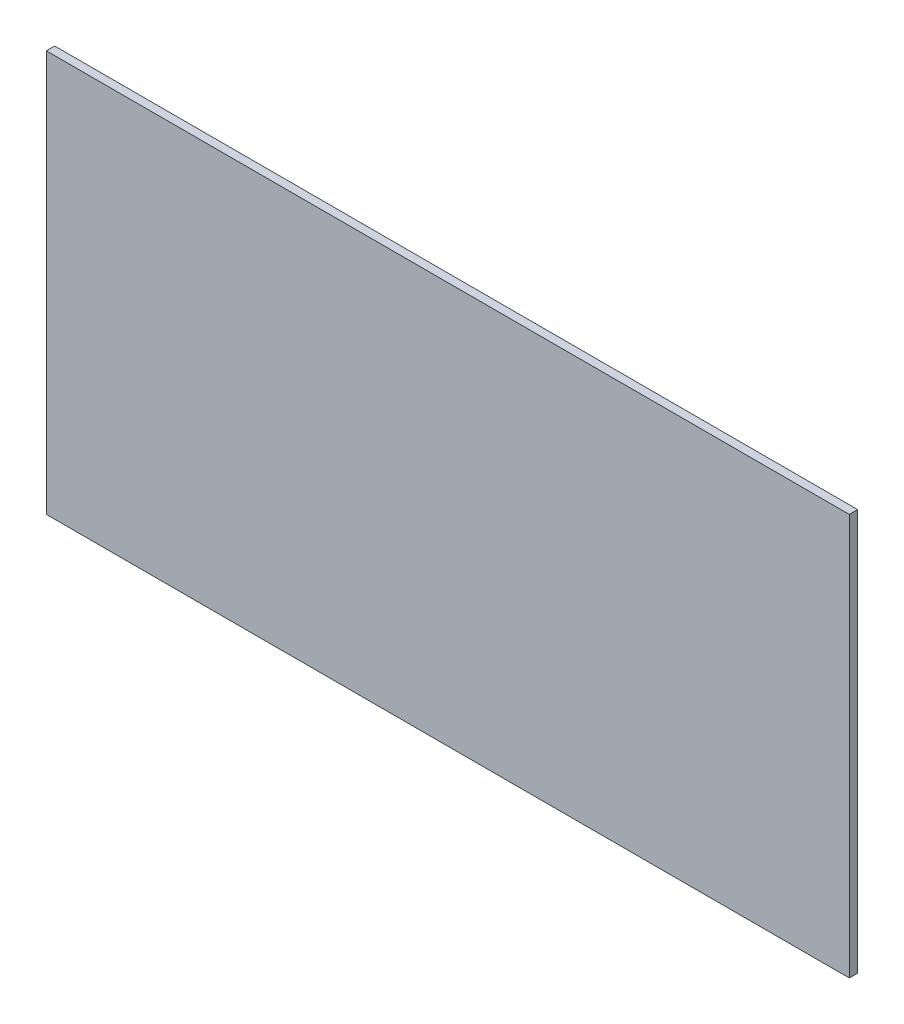
ISO-10303-21;
HEADER;
FILE_DESCRIPTION(('STEP AP214'),'2;1');
FILE_NAME('part.step','',(''),(''),'','','');
FILE_SCHEMA(('AUTOMOTIVE_DESIGN { 1 0 10303 214 1 1 1 1 }'));
ENDSEC;
DATA;
#1=APPLICATION_CONTEXT('core data for automotive mechanical design processes');
#2=APPLICATION_PROTOCOL_DEFINITION('international standard','automotive_design',2000,#1);
#3=PRODUCT_CONTEXT('',#1,'mechanical');
#4=PRODUCT('Part','Part','',(#3));
#5=PRODUCT_RELATED_PRODUCT_CATEGORY('part','',(#4));
#6=PRODUCT_DEFINITION_FORMATION('','',#4);
#7=PRODUCT_DEFINITION_CONTEXT('part definition',#1,'design');
#8=PRODUCT_DEFINITION('design','',#6,#7);
#9=PRODUCT_DEFINITION_SHAPE('','',#8);
#10=(LENGTH_UNIT() NAMED_UNIT(*) SI_UNIT(.MILLI.,.METRE.));
#11=(NAMED_UNIT(*) PLANE_ANGLE_UNIT() SI_UNIT($,.RADIAN.));
#12=(NAMED_UNIT(*) SI_UNIT($,.STERADIAN.) SOLID_ANGLE_UNIT());
#13=UNCERTAINTY_MEASURE_WITH_UNIT(LENGTH_MEASURE(1.E-05),#10,'distance_accuracy_value','');
#14=(GEOMETRIC_REPRESENTATION_CONTEXT(3) GLOBAL_UNCERTAINTY_ASSIGNED_CONTEXT((#13)) GLOBAL_UNIT_ASSIGNED_CONTEXT((#10,
#11,#12)) REPRESENTATION_CONTEXT('',''));
#15=CARTESIAN_POINT('',(0.,0.,0.));
#16=DIRECTION('',(0.,0.,1.));
#17=DIRECTION('',(1.,0.,0.));
#18=AXIS2_PLACEMENT_3D('',#15,#16,#17);
#19=CARTESIAN_POINT('',(304.8,-152.4,6.35));
#20=DIRECTION('',(-1.,0.,0.));
#21=DIRECTION('',(0.,0.,1.));
#22=AXIS2_PLACEMENT_3D('',#19,#20,#21);
#23=PLANE('',#22);
#24=DIRECTION('',(0.,1.,0.));
#25=VECTOR('',#24,1.);
#26=CARTESIAN_POINT('',(304.8,-152.4,0.));
#27=LINE('',#26,#25);
#28=CARTESIAN_POINT('',(304.8,-152.4,0.));
#29=VERTEX_POINT('',#28);
#30=CARTESIAN_POINT('',(304.8,152.4,0.));
#31=VERTEX_POINT('',#30);
#32=EDGE_CURVE('E100',#29,#31,#27,.T.);
#33=ORIENTED_EDGE('',*,*,#32,.T.);
#34=DIRECTION('',(0.,0.,-1.));
#35=VECTOR('',#34,1.);
#36=CARTESIAN_POINT('',(304.8,152.4,6.35));
#37=LINE('',#36,#35);
#38=CARTESIAN_POINT('',(304.8,152.4,6.35));
#39=VERTEX_POINT('',#38);
#40=EDGE_CURVE('E11',#39,#31,#37,.T.);
#41=ORIENTED_EDGE('',*,*,#40,.F.);
#42=DIRECTION('',(0.,1.,0.));
#43=VECTOR('',#42,1.);
#44=CARTESIAN_POINT('',(304.8,-152.4,6.35));
#45=LINE('',#44,#43);
#46=CARTESIAN_POINT('',(304.8,-152.4,6.35));
#47=VERTEX_POINT('',#46);
#48=EDGE_CURVE('E88',#47,#39,#45,.T.);
#49=ORIENTED_EDGE('',*,*,#48,.F.);
#50=DIRECTION('',(0.,0.,-1.));
#51=VECTOR('',#50,1.);
#52=CARTESIAN_POINT('',(304.8,-152.4,6.35));
#53=LINE('',#52,#51);
#54=EDGE_CURVE('E96',#47,#29,#53,.T.);
#55=ORIENTED_EDGE('',*,*,#54,.T.);
#56=EDGE_LOOP('',(#33,#41,#49,#55));
#57=FACE_BOUND('',#56,.T.);
#58=ADVANCED_FACE('F37',(#57),#23,.F.);
#59=CARTESIAN_POINT('',(-304.8,152.4,6.35));
#60=DIRECTION('',(0.,-1.,0.));
#61=DIRECTION('',(0.,0.,-1.));
#62=AXIS2_PLACEMENT_3D('',#59,#60,#61);
#63=PLANE('',#62);
#64=DIRECTION('',(-1.,0.,0.));
#65=VECTOR('',#64,1.);
#66=CARTESIAN_POINT('',(-304.8,152.4,0.));
#67=LINE('',#66,#65);
#68=CARTESIAN_POINT('',(-304.8,152.4,0.));
#69=VERTEX_POINT('',#68);
#70=EDGE_CURVE('E92',#31,#69,#67,.T.);
#71=ORIENTED_EDGE('',*,*,#70,.T.);
#72=DIRECTION('',(0.,0.,-1.));
#73=VECTOR('',#72,1.);
#74=CARTESIAN_POINT('',(-304.8,152.4,6.35));
#75=LINE('',#74,#73);
#76=CARTESIAN_POINT('',(-304.8,152.4,6.35));
#77=VERTEX_POINT('',#76);
#78=EDGE_CURVE('E45',#77,#69,#75,.T.);
#79=ORIENTED_EDGE('',*,*,#78,.F.);
#80=DIRECTION('',(-1.,0.,0.));
#81=VECTOR('',#80,1.);
#82=CARTESIAN_POINT('',(-304.8,152.4,6.35));
#83=LINE('',#82,#81);
#84=EDGE_CURVE('E83',#39,#77,#83,.T.);
#85=ORIENTED_EDGE('',*,*,#84,.F.);
#86=ORIENTED_EDGE('',*,*,#40,.T.);
#87=EDGE_LOOP('',(#71,#79,#85,#86));
#88=FACE_BOUND('',#87,.T.);
#89=ADVANCED_FACE('F91',(#88),#63,.F.);
#90=CARTESIAN_POINT('',(-304.8,-152.4,6.35));
#91=DIRECTION('',(1.,0.,0.));
#92=DIRECTION('',(0.,0.,-1.));
#93=AXIS2_PLACEMENT_3D('',#90,#91,#92);
#94=PLANE('',#93);
#95=DIRECTION('',(0.,-1.,0.));
#96=VECTOR('',#95,1.);
#97=CARTESIAN_POINT('',(-304.8,-152.4,0.));
#98=LINE('',#97,#96);
#99=CARTESIAN_POINT('',(-304.8,-152.4,0.));
#100=VERTEX_POINT('',#99);
#101=EDGE_CURVE('E70',#69,#100,#98,.T.);
#102=ORIENTED_EDGE('',*,*,#101,.T.);
#103=DIRECTION('',(0.,0.,-1.));
#104=VECTOR('',#103,1.);
#105=CARTESIAN_POINT('',(-304.8,-152.4,6.35));
#106=LINE('',#105,#104);
#107=CARTESIAN_POINT('',(-304.8,-152.4,6.35));
#108=VERTEX_POINT('',#107);
#109=EDGE_CURVE('E93',#108,#100,#106,.T.);
#110=ORIENTED_EDGE('',*,*,#109,.F.);
#111=DIRECTION('',(0.,-1.,0.));
#112=VECTOR('',#111,1.);
#113=CARTESIAN_POINT('',(-304.8,-152.4,6.35));
#114=LINE('',#113,#112);
#115=EDGE_CURVE('E86',#77,#108,#114,.T.);
#116=ORIENTED_EDGE('',*,*,#115,.F.);
#117=ORIENTED_EDGE('',*,*,#78,.T.);
#118=EDGE_LOOP('',(#102,#110,#116,#117));
#119=FACE_BOUND('',#118,.T.);
#120=ADVANCED_FACE('F94',(#119),#94,.F.);
#121=CARTESIAN_POINT('',(-304.8,-152.4,6.35));
#122=DIRECTION('',(0.,1.,0.));
#123=DIRECTION('',(0.,0.,1.));
#124=AXIS2_PLACEMENT_3D('',#121,#122,#123);
#125=PLANE('',#124);
#126=DIRECTION('',(1.,0.,0.));
#127=VECTOR('',#126,1.);
#128=CARTESIAN_POINT('',(-304.8,-152.4,0.));
#129=LINE('',#128,#127);
#130=EDGE_CURVE('E76',#100,#29,#129,.T.);
#131=ORIENTED_EDGE('',*,*,#130,.T.);
#132=ORIENTED_EDGE('',*,*,#54,.F.);
#133=DIRECTION('',(1.,0.,0.));
#134=VECTOR('',#133,1.);
#135=CARTESIAN_POINT('',(-304.8,-152.4,6.35));
#136=LINE('',#135,#134);
#137=EDGE_CURVE('E53',#108,#47,#136,.T.);
#138=ORIENTED_EDGE('',*,*,#137,.F.);
#139=ORIENTED_EDGE('',*,*,#109,.T.);
#140=EDGE_LOOP('',(#131,#132,#138,#139));
#141=FACE_BOUND('',#140,.T.);
#142=ADVANCED_FACE('F107',(#141),#125,.F.);
#143=CARTESIAN_POINT('',(0.,0.,6.35));
#144=DIRECTION('',(0.,0.,-1.));
#145=DIRECTION('',(-1.,0.,0.));
#146=AXIS2_PLACEMENT_3D('',#143,#144,#145);
#147=PLANE('',#146);
#148=ORIENTED_EDGE('',*,*,#48,.T.);
#149=ORIENTED_EDGE('',*,*,#84,.T.);
#150=ORIENTED_EDGE('',*,*,#115,.T.);
#151=ORIENTED_EDGE('',*,*,#137,.T.);
#152=EDGE_LOOP('',(#148,#149,#150,#151));
#153=FACE_BOUND('',#152,.T.);
#154=ADVANCED_FACE('F84',(#153),#147,.F.);
#155=CARTESIAN_POINT('',(0.,0.,0.));
#156=DIRECTION('',(0.,0.,-1.));
#157=DIRECTION('',(-1.,0.,0.));
#158=AXIS2_PLACEMENT_3D('',#155,#156,#157);
#159=PLANE('',#158);
#160=ORIENTED_EDGE('',*,*,#32,.F.);
#161=ORIENTED_EDGE('',*,*,#130,.F.);
#162=ORIENTED_EDGE('',*,*,#101,.F.);
#163=ORIENTED_EDGE('',*,*,#70,.F.);
#164=EDGE_LOOP('',(#160,#161,#162,#163));
#165=FACE_BOUND('',#164,.T.);
#166=ADVANCED_FACE('F110',(#165),#159,.T.);
#167=CLOSED_SHELL('',(#58,#89,#120,#142,#154,#166));
#168=MANIFOLD_SOLID_BREP('B2',#167);
#169=ADVANCED_BREP_SHAPE_REPRESENTATION('',(#18,#168),#14);
#170=SHAPE_DEFINITION_REPRESENTATION(#9,#169);
ENDSEC;
END-ISO-10303-21;
